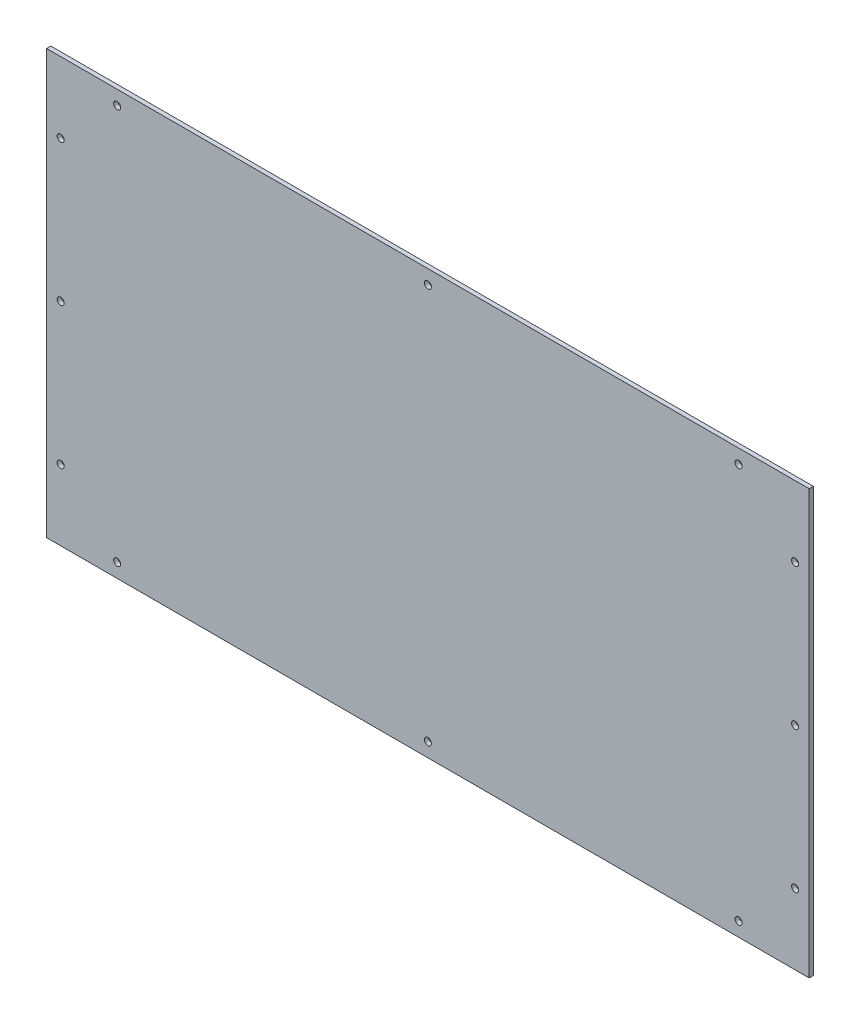
ISO-10303-21;
HEADER;
FILE_DESCRIPTION(('STEP AP214'),'2;1');
FILE_NAME('part.step','',(''),(''),'','','');
FILE_SCHEMA(('AUTOMOTIVE_DESIGN { 1 0 10303 214 1 1 1 1 }'));
ENDSEC;
DATA;
#1=APPLICATION_CONTEXT('core data for automotive mechanical design processes');
#2=APPLICATION_PROTOCOL_DEFINITION('international standard','automotive_design',2000,#1);
#3=PRODUCT_CONTEXT('',#1,'mechanical');
#4=PRODUCT('Part','Part','',(#3));
#5=PRODUCT_RELATED_PRODUCT_CATEGORY('part','',(#4));
#6=PRODUCT_DEFINITION_FORMATION('','',#4);
#7=PRODUCT_DEFINITION_CONTEXT('part definition',#1,'design');
#8=PRODUCT_DEFINITION('design','',#6,#7);
#9=PRODUCT_DEFINITION_SHAPE('','',#8);
#10=(LENGTH_UNIT() NAMED_UNIT(*) SI_UNIT(.MILLI.,.METRE.));
#11=(NAMED_UNIT(*) PLANE_ANGLE_UNIT() SI_UNIT($,.RADIAN.));
#12=(NAMED_UNIT(*) SI_UNIT($,.STERADIAN.) SOLID_ANGLE_UNIT());
#13=UNCERTAINTY_MEASURE_WITH_UNIT(LENGTH_MEASURE(1.E-05),#10,'distance_accuracy_value','');
#14=(GEOMETRIC_REPRESENTATION_CONTEXT(3) GLOBAL_UNCERTAINTY_ASSIGNED_CONTEXT((#13)) GLOBAL_UNIT_ASSIGNED_CONTEXT((#10,
#11,#12)) REPRESENTATION_CONTEXT('',''));
#15=CARTESIAN_POINT('',(0.,0.,0.));
#16=DIRECTION('',(0.,0.,1.));
#17=DIRECTION('',(1.,0.,0.));
#18=AXIS2_PLACEMENT_3D('',#15,#16,#17);
#19=CARTESIAN_POINT('',(270.,150.,3.));
#20=DIRECTION('',(-1.,0.,0.));
#21=DIRECTION('',(0.,0.,1.));
#22=AXIS2_PLACEMENT_3D('',#19,#20,#21);
#23=PLANE('',#22);
#24=DIRECTION('',(0.,1.,0.));
#25=VECTOR('',#24,1.);
#26=CARTESIAN_POINT('',(270.,150.,0.));
#27=LINE('',#26,#25);
#28=CARTESIAN_POINT('',(270.,-150.,0.));
#29=VERTEX_POINT('',#28);
#30=CARTESIAN_POINT('',(270.,150.,0.));
#31=VERTEX_POINT('',#30);
#32=EDGE_CURVE('E102',#29,#31,#27,.T.);
#33=ORIENTED_EDGE('',*,*,#32,.T.);
#34=DIRECTION('',(0.,0.,-1.));
#35=VECTOR('',#34,1.);
#36=CARTESIAN_POINT('',(270.,150.,3.));
#37=LINE('',#36,#35);
#38=CARTESIAN_POINT('',(270.,150.,3.));
#39=VERTEX_POINT('',#38);
#40=EDGE_CURVE('E11',#39,#31,#37,.T.);
#41=ORIENTED_EDGE('',*,*,#40,.F.);
#42=DIRECTION('',(0.,1.,0.));
#43=VECTOR('',#42,1.);
#44=CARTESIAN_POINT('',(270.,150.,3.));
#45=LINE('',#44,#43);
#46=CARTESIAN_POINT('',(270.,-150.,3.));
#47=VERTEX_POINT('',#46);
#48=EDGE_CURVE('E90',#47,#39,#45,.T.);
#49=ORIENTED_EDGE('',*,*,#48,.F.);
#50=DIRECTION('',(0.,0.,-1.));
#51=VECTOR('',#50,1.);
#52=CARTESIAN_POINT('',(270.,-150.,3.));
#53=LINE('',#52,#51);
#54=EDGE_CURVE('E98',#47,#29,#53,.T.);
#55=ORIENTED_EDGE('',*,*,#54,.T.);
#56=EDGE_LOOP('',(#33,#41,#49,#55));
#57=FACE_BOUND('',#56,.T.);
#58=ADVANCED_FACE('F39',(#57),#23,.F.);
#59=CARTESIAN_POINT('',(-270.,150.,3.));
#60=DIRECTION('',(0.,-1.,0.));
#61=DIRECTION('',(0.,0.,-1.));
#62=AXIS2_PLACEMENT_3D('',#59,#60,#61);
#63=PLANE('',#62);
#64=DIRECTION('',(-1.,0.,0.));
#65=VECTOR('',#64,1.);
#66=CARTESIAN_POINT('',(-270.,150.,0.));
#67=LINE('',#66,#65);
#68=CARTESIAN_POINT('',(-270.,150.,0.));
#69=VERTEX_POINT('',#68);
#70=EDGE_CURVE('E94',#31,#69,#67,.T.);
#71=ORIENTED_EDGE('',*,*,#70,.T.);
#72=DIRECTION('',(0.,0.,-1.));
#73=VECTOR('',#72,1.);
#74=CARTESIAN_POINT('',(-270.,150.,3.));
#75=LINE('',#74,#73);
#76=CARTESIAN_POINT('',(-270.,150.,3.));
#77=VERTEX_POINT('',#76);
#78=EDGE_CURVE('E47',#77,#69,#75,.T.);
#79=ORIENTED_EDGE('',*,*,#78,.F.);
#80=DIRECTION('',(-1.,0.,0.));
#81=VECTOR('',#80,1.);
#82=CARTESIAN_POINT('',(-270.,150.,3.));
#83=LINE('',#82,#81);
#84=EDGE_CURVE('E85',#39,#77,#83,.T.);
#85=ORIENTED_EDGE('',*,*,#84,.F.);
#86=ORIENTED_EDGE('',*,*,#40,.T.);
#87=EDGE_LOOP('',(#71,#79,#85,#86));
#88=FACE_BOUND('',#87,.T.);
#89=ADVANCED_FACE('F93',(#88),#63,.F.);
#90=CARTESIAN_POINT('',(-270.,150.,3.));
#91=DIRECTION('',(1.,0.,0.));
#92=DIRECTION('',(0.,1.,0.));
#93=AXIS2_PLACEMENT_3D('',#90,#91,#92);
#94=PLANE('',#93);
#95=DIRECTION('',(0.,-1.,0.));
#96=VECTOR('',#95,1.);
#97=CARTESIAN_POINT('',(-270.,150.,0.));
#98=LINE('',#97,#96);
#99=CARTESIAN_POINT('',(-270.,-150.,0.));
#100=VERTEX_POINT('',#99);
#101=EDGE_CURVE('E72',#69,#100,#98,.T.);
#102=ORIENTED_EDGE('',*,*,#101,.T.);
#103=DIRECTION('',(0.,0.,-1.));
#104=VECTOR('',#103,1.);
#105=CARTESIAN_POINT('',(-270.,-150.,3.));
#106=LINE('',#105,#104);
#107=CARTESIAN_POINT('',(-270.,-150.,3.));
#108=VERTEX_POINT('',#107);
#109=EDGE_CURVE('E95',#108,#100,#106,.T.);
#110=ORIENTED_EDGE('',*,*,#109,.F.);
#111=DIRECTION('',(0.,-1.,0.));
#112=VECTOR('',#111,1.);
#113=CARTESIAN_POINT('',(-270.,150.,3.));
#114=LINE('',#113,#112);
#115=EDGE_CURVE('E88',#77,#108,#114,.T.);
#116=ORIENTED_EDGE('',*,*,#115,.F.);
#117=ORIENTED_EDGE('',*,*,#78,.T.);
#118=EDGE_LOOP('',(#102,#110,#116,#117));
#119=FACE_BOUND('',#118,.T.);
#120=ADVANCED_FACE('F96',(#119),#94,.F.);
#121=CARTESIAN_POINT('',(-270.,-150.,3.));
#122=DIRECTION('',(0.,1.,0.));
#123=DIRECTION('',(0.,0.,1.));
#124=AXIS2_PLACEMENT_3D('',#121,#122,#123);
#125=PLANE('',#124);
#126=DIRECTION('',(1.,0.,0.));
#127=VECTOR('',#126,1.);
#128=CARTESIAN_POINT('',(-270.,-150.,0.));
#129=LINE('',#128,#127);
#130=EDGE_CURVE('E78',#100,#29,#129,.T.);
#131=ORIENTED_EDGE('',*,*,#130,.T.);
#132=ORIENTED_EDGE('',*,*,#54,.F.);
#133=DIRECTION('',(1.,0.,0.));
#134=VECTOR('',#133,1.);
#135=CARTESIAN_POINT('',(-270.,-150.,3.));
#136=LINE('',#135,#134);
#137=EDGE_CURVE('E55',#108,#47,#136,.T.);
#138=ORIENTED_EDGE('',*,*,#137,.F.);
#139=ORIENTED_EDGE('',*,*,#109,.T.);
#140=EDGE_LOOP('',(#131,#132,#138,#139));
#141=FACE_BOUND('',#140,.T.);
#142=ADVANCED_FACE('F110',(#141),#125,.F.);
#143=CARTESIAN_POINT('',(0.,0.,3.));
#144=DIRECTION('',(0.,0.,1.));
#145=DIRECTION('',(1.,0.,0.));
#146=AXIS2_PLACEMENT_3D('',#143,#144,#145);
#147=PLANE('',#146);
#148=CARTESIAN_POINT('',(-220.,-139.999999999999,3.));
#149=DIRECTION('',(0.,0.,1.));
#150=DIRECTION('',(-1.,0.,0.));
#151=AXIS2_PLACEMENT_3D('',#148,#149,#150);
#152=CIRCLE('',#151,2.5);
#153=CARTESIAN_POINT('',(-222.5,-139.999999999999,3.));
#154=VERTEX_POINT('',#153);
#155=EDGE_CURVE('E122',#154,#154,#152,.T.);
#156=ORIENTED_EDGE('',*,*,#155,.F.);
#157=EDGE_LOOP('',(#156));
#158=FACE_BOUND('',#157,.T.);
#159=CARTESIAN_POINT('',(0.,-140.,3.));
#160=DIRECTION('',(0.,0.,1.));
#161=DIRECTION('',(-1.,0.,0.));
#162=AXIS2_PLACEMENT_3D('',#159,#160,#161);
#163=CIRCLE('',#162,2.5);
#164=CARTESIAN_POINT('',(-2.5,-140.,3.));
#165=VERTEX_POINT('',#164);
#166=EDGE_CURVE('E128',#165,#165,#163,.T.);
#167=ORIENTED_EDGE('',*,*,#166,.F.);
#168=EDGE_LOOP('',(#167));
#169=FACE_BOUND('',#168,.T.);
#170=CARTESIAN_POINT('',(220.,-139.999999999999,3.));
#171=DIRECTION('',(0.,0.,1.));
#172=DIRECTION('',(1.,0.,0.));
#173=AXIS2_PLACEMENT_3D('',#170,#171,#172);
#174=CIRCLE('',#173,2.5);
#175=CARTESIAN_POINT('',(222.5,-139.999999999999,3.));
#176=VERTEX_POINT('',#175);
#177=EDGE_CURVE('E134',#176,#176,#174,.T.);
#178=ORIENTED_EDGE('',*,*,#177,.F.);
#179=EDGE_LOOP('',(#178));
#180=FACE_BOUND('',#179,.T.);
#181=CARTESIAN_POINT('',(220.,139.999999999999,3.));
#182=DIRECTION('',(0.,0.,1.));
#183=DIRECTION('',(-1.,0.,0.));
#184=AXIS2_PLACEMENT_3D('',#181,#182,#183);
#185=CIRCLE('',#184,2.5);
#186=CARTESIAN_POINT('',(217.5,139.999999999999,3.));
#187=VERTEX_POINT('',#186);
#188=EDGE_CURVE('E148',#187,#187,#185,.T.);
#189=ORIENTED_EDGE('',*,*,#188,.F.);
#190=EDGE_LOOP('',(#189));
#191=FACE_BOUND('',#190,.T.);
#192=CARTESIAN_POINT('',(260.,-100.,3.));
#193=DIRECTION('',(0.,0.,1.));
#194=DIRECTION('',(1.,0.,0.));
#195=AXIS2_PLACEMENT_3D('',#192,#193,#194);
#196=CIRCLE('',#195,2.50000000000002);
#197=CARTESIAN_POINT('',(262.5,-100.,3.));
#198=VERTEX_POINT('',#197);
#199=EDGE_CURVE('E141',#198,#198,#196,.T.);
#200=ORIENTED_EDGE('',*,*,#199,.F.);
#201=EDGE_LOOP('',(#200));
#202=FACE_BOUND('',#201,.T.);
#203=CARTESIAN_POINT('',(260.,0.,3.));
#204=DIRECTION('',(0.,0.,1.));
#205=DIRECTION('',(-1.,0.,0.));
#206=AXIS2_PLACEMENT_3D('',#203,#204,#205);
#207=CIRCLE('',#206,2.50000000000008);
#208=CARTESIAN_POINT('',(257.5,0.,3.));
#209=VERTEX_POINT('',#208);
#210=EDGE_CURVE('E160',#209,#209,#207,.T.);
#211=ORIENTED_EDGE('',*,*,#210,.F.);
#212=EDGE_LOOP('',(#211));
#213=FACE_BOUND('',#212,.T.);
#214=CARTESIAN_POINT('',(260.,100.,3.));
#215=DIRECTION('',(0.,0.,1.));
#216=DIRECTION('',(-1.,0.,0.));
#217=AXIS2_PLACEMENT_3D('',#214,#215,#216);
#218=CIRCLE('',#217,2.50000000000002);
#219=CARTESIAN_POINT('',(257.5,100.,3.));
#220=VERTEX_POINT('',#219);
#221=EDGE_CURVE('E140',#220,#220,#218,.T.);
#222=ORIENTED_EDGE('',*,*,#221,.F.);
#223=EDGE_LOOP('',(#222));
#224=FACE_BOUND('',#223,.T.);
#225=CARTESIAN_POINT('',(-260.,0.,3.));
#226=DIRECTION('',(0.,0.,1.));
#227=DIRECTION('',(1.,0.,0.));
#228=AXIS2_PLACEMENT_3D('',#225,#226,#227);
#229=CIRCLE('',#228,2.50000000000002);
#230=CARTESIAN_POINT('',(-257.5,0.,3.));
#231=VERTEX_POINT('',#230);
#232=EDGE_CURVE('E172',#231,#231,#229,.T.);
#233=ORIENTED_EDGE('',*,*,#232,.F.);
#234=EDGE_LOOP('',(#233));
#235=FACE_BOUND('',#234,.T.);
#236=CARTESIAN_POINT('',(-220.,139.999999999999,3.));
#237=DIRECTION('',(0.,0.,1.));
#238=DIRECTION('',(1.,0.,0.));
#239=AXIS2_PLACEMENT_3D('',#236,#237,#238);
#240=CIRCLE('',#239,2.5);
#241=CARTESIAN_POINT('',(-217.5,139.999999999999,3.));
#242=VERTEX_POINT('',#241);
#243=EDGE_CURVE('E165',#242,#242,#240,.T.);
#244=ORIENTED_EDGE('',*,*,#243,.F.);
#245=EDGE_LOOP('',(#244));
#246=FACE_BOUND('',#245,.T.);
#247=CARTESIAN_POINT('',(-260.,-100.,3.));
#248=DIRECTION('',(0.,0.,1.));
#249=DIRECTION('',(-1.,0.,0.));
#250=AXIS2_PLACEMENT_3D('',#247,#248,#249);
#251=CIRCLE('',#250,2.50000000000002);
#252=CARTESIAN_POINT('',(-262.5,-100.,3.));
#253=VERTEX_POINT('',#252);
#254=EDGE_CURVE('E182',#253,#253,#251,.T.);
#255=ORIENTED_EDGE('',*,*,#254,.F.);
#256=EDGE_LOOP('',(#255));
#257=FACE_BOUND('',#256,.T.);
#258=CARTESIAN_POINT('',(-260.,100.,3.));
#259=DIRECTION('',(0.,0.,1.));
#260=DIRECTION('',(1.,0.,0.));
#261=AXIS2_PLACEMENT_3D('',#258,#259,#260);
#262=CIRCLE('',#261,2.50000000000002);
#263=CARTESIAN_POINT('',(-257.5,100.,3.));
#264=VERTEX_POINT('',#263);
#265=EDGE_CURVE('E154',#264,#264,#262,.T.);
#266=ORIENTED_EDGE('',*,*,#265,.F.);
#267=EDGE_LOOP('',(#266));
#268=FACE_BOUND('',#267,.T.);
#269=CARTESIAN_POINT('',(0.,140.,3.));
#270=DIRECTION('',(0.,0.,1.));
#271=DIRECTION('',(1.,0.,0.));
#272=AXIS2_PLACEMENT_3D('',#269,#270,#271);
#273=CIRCLE('',#272,2.5);
#274=CARTESIAN_POINT('',(2.5,140.,3.));
#275=VERTEX_POINT('',#274);
#276=EDGE_CURVE('E116',#275,#275,#273,.T.);
#277=ORIENTED_EDGE('',*,*,#276,.F.);
#278=EDGE_LOOP('',(#277));
#279=FACE_BOUND('',#278,.T.);
#280=ORIENTED_EDGE('',*,*,#48,.T.);
#281=ORIENTED_EDGE('',*,*,#84,.T.);
#282=ORIENTED_EDGE('',*,*,#115,.T.);
#283=ORIENTED_EDGE('',*,*,#137,.T.);
#284=EDGE_LOOP('',(#280,#281,#282,#283));
#285=FACE_BOUND('',#284,.T.);
#286=ADVANCED_FACE('F86',(#158,#169,#180,#191,#202,#213,#224,#235,#246,#257,#268,#279,#285),
#147,.T.);
#287=CARTESIAN_POINT('',(0.,0.,0.));
#288=DIRECTION('',(0.,0.,1.));
#289=DIRECTION('',(1.,0.,0.));
#290=AXIS2_PLACEMENT_3D('',#287,#288,#289);
#291=PLANE('',#290);
#292=CARTESIAN_POINT('',(-220.,-139.999999999999,0.));
#293=DIRECTION('',(0.,0.,1.));
#294=DIRECTION('',(-1.,0.,0.));
#295=AXIS2_PLACEMENT_3D('',#292,#293,#294);
#296=CIRCLE('',#295,2.5);
#297=CARTESIAN_POINT('',(-222.5,-139.999999999999,0.));
#298=VERTEX_POINT('',#297);
#299=EDGE_CURVE('E125',#298,#298,#296,.T.);
#300=ORIENTED_EDGE('',*,*,#299,.T.);
#301=EDGE_LOOP('',(#300));
#302=FACE_BOUND('',#301,.T.);
#303=CARTESIAN_POINT('',(0.,-140.,0.));
#304=DIRECTION('',(0.,0.,1.));
#305=DIRECTION('',(-1.,0.,0.));
#306=AXIS2_PLACEMENT_3D('',#303,#304,#305);
#307=CIRCLE('',#306,2.5);
#308=CARTESIAN_POINT('',(-2.5,-140.,0.));
#309=VERTEX_POINT('',#308);
#310=EDGE_CURVE('E131',#309,#309,#307,.T.);
#311=ORIENTED_EDGE('',*,*,#310,.T.);
#312=EDGE_LOOP('',(#311));
#313=FACE_BOUND('',#312,.T.);
#314=CARTESIAN_POINT('',(220.,-139.999999999999,0.));
#315=DIRECTION('',(0.,0.,1.));
#316=DIRECTION('',(1.,0.,0.));
#317=AXIS2_PLACEMENT_3D('',#314,#315,#316);
#318=CIRCLE('',#317,2.5);
#319=CARTESIAN_POINT('',(222.5,-139.999999999999,0.));
#320=VERTEX_POINT('',#319);
#321=EDGE_CURVE('E137',#320,#320,#318,.T.);
#322=ORIENTED_EDGE('',*,*,#321,.T.);
#323=EDGE_LOOP('',(#322));
#324=FACE_BOUND('',#323,.T.);
#325=CARTESIAN_POINT('',(220.,139.999999999999,0.));
#326=DIRECTION('',(0.,0.,1.));
#327=DIRECTION('',(-1.,0.,0.));
#328=AXIS2_PLACEMENT_3D('',#325,#326,#327);
#329=CIRCLE('',#328,2.5);
#330=CARTESIAN_POINT('',(217.5,139.999999999999,0.));
#331=VERTEX_POINT('',#330);
#332=EDGE_CURVE('E151',#331,#331,#329,.T.);
#333=ORIENTED_EDGE('',*,*,#332,.T.);
#334=EDGE_LOOP('',(#333));
#335=FACE_BOUND('',#334,.T.);
#336=CARTESIAN_POINT('',(260.,-100.,0.));
#337=DIRECTION('',(0.,0.,1.));
#338=DIRECTION('',(1.,0.,0.));
#339=AXIS2_PLACEMENT_3D('',#336,#337,#338);
#340=CIRCLE('',#339,2.50000000000002);
#341=CARTESIAN_POINT('',(262.5,-100.,0.));
#342=VERTEX_POINT('',#341);
#343=EDGE_CURVE('E144',#342,#342,#340,.T.);
#344=ORIENTED_EDGE('',*,*,#343,.T.);
#345=EDGE_LOOP('',(#344));
#346=FACE_BOUND('',#345,.T.);
#347=CARTESIAN_POINT('',(260.,0.,0.));
#348=DIRECTION('',(0.,0.,1.));
#349=DIRECTION('',(-1.,0.,0.));
#350=AXIS2_PLACEMENT_3D('',#347,#348,#349);
#351=CIRCLE('',#350,2.50000000000008);
#352=CARTESIAN_POINT('',(257.5,0.,0.));
#353=VERTEX_POINT('',#352);
#354=EDGE_CURVE('E145',#353,#353,#351,.T.);
#355=ORIENTED_EDGE('',*,*,#354,.T.);
#356=EDGE_LOOP('',(#355));
#357=FACE_BOUND('',#356,.T.);
#358=CARTESIAN_POINT('',(260.,100.,0.));
#359=DIRECTION('',(0.,0.,1.));
#360=DIRECTION('',(-1.,0.,0.));
#361=AXIS2_PLACEMENT_3D('',#358,#359,#360);
#362=CIRCLE('',#361,2.50000000000002);
#363=CARTESIAN_POINT('',(257.5,100.,0.));
#364=VERTEX_POINT('',#363);
#365=EDGE_CURVE('E157',#364,#364,#362,.T.);
#366=ORIENTED_EDGE('',*,*,#365,.T.);
#367=EDGE_LOOP('',(#366));
#368=FACE_BOUND('',#367,.T.);
#369=CARTESIAN_POINT('',(-260.,0.,0.));
#370=DIRECTION('',(0.,0.,1.));
#371=DIRECTION('',(1.,0.,0.));
#372=AXIS2_PLACEMENT_3D('',#369,#370,#371);
#373=CIRCLE('',#372,2.50000000000002);
#374=CARTESIAN_POINT('',(-257.5,0.,0.));
#375=VERTEX_POINT('',#374);
#376=EDGE_CURVE('E119',#375,#375,#373,.T.);
#377=ORIENTED_EDGE('',*,*,#376,.T.);
#378=EDGE_LOOP('',(#377));
#379=FACE_BOUND('',#378,.T.);
#380=CARTESIAN_POINT('',(-220.,139.999999999999,0.));
#381=DIRECTION('',(0.,0.,1.));
#382=DIRECTION('',(1.,0.,0.));
#383=AXIS2_PLACEMENT_3D('',#380,#381,#382);
#384=CIRCLE('',#383,2.5);
#385=CARTESIAN_POINT('',(-217.5,139.999999999999,0.));
#386=VERTEX_POINT('',#385);
#387=EDGE_CURVE('E168',#386,#386,#384,.T.);
#388=ORIENTED_EDGE('',*,*,#387,.T.);
#389=EDGE_LOOP('',(#388));
#390=FACE_BOUND('',#389,.T.);
#391=CARTESIAN_POINT('',(-260.,-100.,0.));
#392=DIRECTION('',(0.,0.,1.));
#393=DIRECTION('',(-1.,0.,0.));
#394=AXIS2_PLACEMENT_3D('',#391,#392,#393);
#395=CIRCLE('',#394,2.50000000000002);
#396=CARTESIAN_POINT('',(-262.5,-100.,0.));
#397=VERTEX_POINT('',#396);
#398=EDGE_CURVE('E169',#397,#397,#395,.T.);
#399=ORIENTED_EDGE('',*,*,#398,.T.);
#400=EDGE_LOOP('',(#399));
#401=FACE_BOUND('',#400,.T.);
#402=CARTESIAN_POINT('',(-260.,100.,0.));
#403=DIRECTION('',(0.,0.,1.));
#404=DIRECTION('',(1.,0.,0.));
#405=AXIS2_PLACEMENT_3D('',#402,#403,#404);
#406=CIRCLE('',#405,2.50000000000002);
#407=CARTESIAN_POINT('',(-257.5,100.,0.));
#408=VERTEX_POINT('',#407);
#409=EDGE_CURVE('E179',#408,#408,#406,.T.);
#410=ORIENTED_EDGE('',*,*,#409,.T.);
#411=EDGE_LOOP('',(#410));
#412=FACE_BOUND('',#411,.T.);
#413=CARTESIAN_POINT('',(0.,140.,0.));
#414=DIRECTION('',(0.,0.,1.));
#415=DIRECTION('',(1.,0.,0.));
#416=AXIS2_PLACEMENT_3D('',#413,#414,#415);
#417=CIRCLE('',#416,2.5);
#418=CARTESIAN_POINT('',(2.5,140.,0.));
#419=VERTEX_POINT('',#418);
#420=EDGE_CURVE('E105',#419,#419,#417,.T.);
#421=ORIENTED_EDGE('',*,*,#420,.T.);
#422=EDGE_LOOP('',(#421));
#423=FACE_BOUND('',#422,.T.);
#424=ORIENTED_EDGE('',*,*,#32,.F.);
#425=ORIENTED_EDGE('',*,*,#130,.F.);
#426=ORIENTED_EDGE('',*,*,#101,.F.);
#427=ORIENTED_EDGE('',*,*,#70,.F.);
#428=EDGE_LOOP('',(#424,#425,#426,#427));
#429=FACE_BOUND('',#428,.T.);
#430=ADVANCED_FACE('F113',(#302,#313,#324,#335,#346,#357,#368,#379,#390,#401,#412,#423,#429),
#291,.F.);
#431=CARTESIAN_POINT('',(0.,140.,0.));
#432=DIRECTION('',(0.,0.,1.));
#433=DIRECTION('',(1.,0.,0.));
#434=AXIS2_PLACEMENT_3D('',#431,#432,#433);
#435=CYLINDRICAL_SURFACE('',#434,2.5);
#436=ORIENTED_EDGE('',*,*,#420,.F.);
#437=EDGE_LOOP('',(#436));
#438=FACE_BOUND('',#437,.T.);
#439=ORIENTED_EDGE('',*,*,#276,.T.);
#440=EDGE_LOOP('',(#439));
#441=FACE_BOUND('',#440,.T.);
#442=ADVANCED_FACE('F206',(#438,#441),#435,.F.);
#443=CARTESIAN_POINT('',(-260.,100.,0.));
#444=DIRECTION('',(0.,0.,1.));
#445=DIRECTION('',(1.,0.,0.));
#446=AXIS2_PLACEMENT_3D('',#443,#444,#445);
#447=CYLINDRICAL_SURFACE('',#446,2.50000000000002);
#448=ORIENTED_EDGE('',*,*,#409,.F.);
#449=EDGE_LOOP('',(#448));
#450=FACE_BOUND('',#449,.T.);
#451=ORIENTED_EDGE('',*,*,#265,.T.);
#452=EDGE_LOOP('',(#451));
#453=FACE_BOUND('',#452,.T.);
#454=ADVANCED_FACE('F194',(#450,#453),#447,.F.);
#455=CARTESIAN_POINT('',(-260.,-100.,0.));
#456=DIRECTION('',(0.,0.,1.));
#457=DIRECTION('',(1.,0.,0.));
#458=AXIS2_PLACEMENT_3D('',#455,#456,#457);
#459=CYLINDRICAL_SURFACE('',#458,2.50000000000002);
#460=ORIENTED_EDGE('',*,*,#398,.F.);
#461=EDGE_LOOP('',(#460));
#462=FACE_BOUND('',#461,.T.);
#463=ORIENTED_EDGE('',*,*,#254,.T.);
#464=EDGE_LOOP('',(#463));
#465=FACE_BOUND('',#464,.T.);
#466=ADVANCED_FACE('F190',(#462,#465),#459,.F.);
#467=CARTESIAN_POINT('',(-220.,139.999999999999,0.));
#468=DIRECTION('',(0.,0.,1.));
#469=DIRECTION('',(1.,0.,0.));
#470=AXIS2_PLACEMENT_3D('',#467,#468,#469);
#471=CYLINDRICAL_SURFACE('',#470,2.5);
#472=ORIENTED_EDGE('',*,*,#387,.F.);
#473=EDGE_LOOP('',(#472));
#474=FACE_BOUND('',#473,.T.);
#475=ORIENTED_EDGE('',*,*,#243,.T.);
#476=EDGE_LOOP('',(#475));
#477=FACE_BOUND('',#476,.T.);
#478=ADVANCED_FACE('F193',(#474,#477),#471,.F.);
#479=CARTESIAN_POINT('',(-260.,0.,0.));
#480=DIRECTION('',(0.,0.,1.));
#481=DIRECTION('',(1.,0.,0.));
#482=AXIS2_PLACEMENT_3D('',#479,#480,#481);
#483=CYLINDRICAL_SURFACE('',#482,2.50000000000002);
#484=ORIENTED_EDGE('',*,*,#376,.F.);
#485=EDGE_LOOP('',(#484));
#486=FACE_BOUND('',#485,.T.);
#487=ORIENTED_EDGE('',*,*,#232,.T.);
#488=EDGE_LOOP('',(#487));
#489=FACE_BOUND('',#488,.T.);
#490=ADVANCED_FACE('F267',(#486,#489),#483,.F.);
#491=CARTESIAN_POINT('',(260.,100.,0.));
#492=DIRECTION('',(0.,0.,1.));
#493=DIRECTION('',(1.,0.,0.));
#494=AXIS2_PLACEMENT_3D('',#491,#492,#493);
#495=CYLINDRICAL_SURFACE('',#494,2.50000000000002);
#496=ORIENTED_EDGE('',*,*,#365,.F.);
#497=EDGE_LOOP('',(#496));
#498=FACE_BOUND('',#497,.T.);
#499=ORIENTED_EDGE('',*,*,#221,.T.);
#500=EDGE_LOOP('',(#499));
#501=FACE_BOUND('',#500,.T.);
#502=ADVANCED_FACE('F277',(#498,#501),#495,.F.);
#503=CARTESIAN_POINT('',(260.,0.,0.));
#504=DIRECTION('',(0.,0.,1.));
#505=DIRECTION('',(1.,0.,0.));
#506=AXIS2_PLACEMENT_3D('',#503,#504,#505);
#507=CYLINDRICAL_SURFACE('',#506,2.50000000000008);
#508=ORIENTED_EDGE('',*,*,#354,.F.);
#509=EDGE_LOOP('',(#508));
#510=FACE_BOUND('',#509,.T.);
#511=ORIENTED_EDGE('',*,*,#210,.T.);
#512=EDGE_LOOP('',(#511));
#513=FACE_BOUND('',#512,.T.);
#514=ADVANCED_FACE('F287',(#510,#513),#507,.F.);
#515=CARTESIAN_POINT('',(260.,-100.,0.));
#516=DIRECTION('',(0.,0.,1.));
#517=DIRECTION('',(1.,0.,0.));
#518=AXIS2_PLACEMENT_3D('',#515,#516,#517);
#519=CYLINDRICAL_SURFACE('',#518,2.50000000000002);
#520=ORIENTED_EDGE('',*,*,#343,.F.);
#521=EDGE_LOOP('',(#520));
#522=FACE_BOUND('',#521,.T.);
#523=ORIENTED_EDGE('',*,*,#199,.T.);
#524=EDGE_LOOP('',(#523));
#525=FACE_BOUND('',#524,.T.);
#526=ADVANCED_FACE('F297',(#522,#525),#519,.F.);
#527=CARTESIAN_POINT('',(220.,139.999999999999,0.));
#528=DIRECTION('',(0.,0.,1.));
#529=DIRECTION('',(1.,0.,0.));
#530=AXIS2_PLACEMENT_3D('',#527,#528,#529);
#531=CYLINDRICAL_SURFACE('',#530,2.5);
#532=ORIENTED_EDGE('',*,*,#332,.F.);
#533=EDGE_LOOP('',(#532));
#534=FACE_BOUND('',#533,.T.);
#535=ORIENTED_EDGE('',*,*,#188,.T.);
#536=EDGE_LOOP('',(#535));
#537=FACE_BOUND('',#536,.T.);
#538=ADVANCED_FACE('F307',(#534,#537),#531,.F.);
#539=CARTESIAN_POINT('',(220.,-139.999999999999,0.));
#540=DIRECTION('',(0.,0.,1.));
#541=DIRECTION('',(1.,0.,0.));
#542=AXIS2_PLACEMENT_3D('',#539,#540,#541);
#543=CYLINDRICAL_SURFACE('',#542,2.5);
#544=ORIENTED_EDGE('',*,*,#321,.F.);
#545=EDGE_LOOP('',(#544));
#546=FACE_BOUND('',#545,.T.);
#547=ORIENTED_EDGE('',*,*,#177,.T.);
#548=EDGE_LOOP('',(#547));
#549=FACE_BOUND('',#548,.T.);
#550=ADVANCED_FACE('F317',(#546,#549),#543,.F.);
#551=CARTESIAN_POINT('',(0.,-140.,0.));
#552=DIRECTION('',(0.,0.,1.));
#553=DIRECTION('',(1.,0.,0.));
#554=AXIS2_PLACEMENT_3D('',#551,#552,#553);
#555=CYLINDRICAL_SURFACE('',#554,2.5);
#556=ORIENTED_EDGE('',*,*,#310,.F.);
#557=EDGE_LOOP('',(#556));
#558=FACE_BOUND('',#557,.T.);
#559=ORIENTED_EDGE('',*,*,#166,.T.);
#560=EDGE_LOOP('',(#559));
#561=FACE_BOUND('',#560,.T.);
#562=ADVANCED_FACE('F327',(#558,#561),#555,.F.);
#563=CARTESIAN_POINT('',(-220.,-139.999999999999,0.));
#564=DIRECTION('',(0.,0.,1.));
#565=DIRECTION('',(1.,0.,0.));
#566=AXIS2_PLACEMENT_3D('',#563,#564,#565);
#567=CYLINDRICAL_SURFACE('',#566,2.5);
#568=ORIENTED_EDGE('',*,*,#299,.F.);
#569=EDGE_LOOP('',(#568));
#570=FACE_BOUND('',#569,.T.);
#571=ORIENTED_EDGE('',*,*,#155,.T.);
#572=EDGE_LOOP('',(#571));
#573=FACE_BOUND('',#572,.T.);
#574=ADVANCED_FACE('F337',(#570,#573),#567,.F.);
#575=CLOSED_SHELL('',(#58,#89,#120,#142,#286,#430,#442,#454,#466,#478,#490,#502,#514,#526,#538,
#550,#562,#574));
#576=MANIFOLD_SOLID_BREP('B2',#575);
#577=ADVANCED_BREP_SHAPE_REPRESENTATION('',(#18,#576),#14);
#578=SHAPE_DEFINITION_REPRESENTATION(#9,#577);
ENDSEC;
END-ISO-10303-21;
